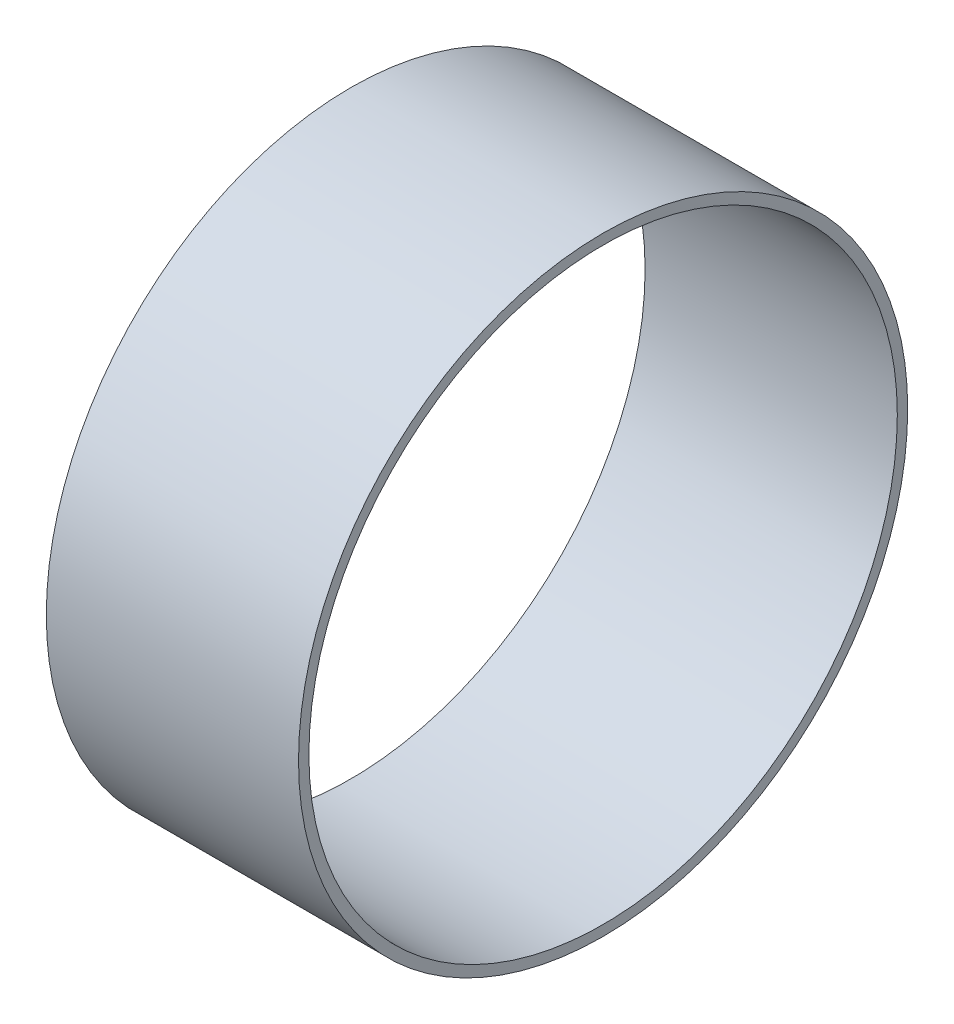
ISO-10303-21;
HEADER;
FILE_DESCRIPTION(('STEP AP214'),'2;1');
FILE_NAME('part.step','',(''),(''),'','','');
FILE_SCHEMA(('AUTOMOTIVE_DESIGN { 1 0 10303 214 1 1 1 1 }'));
ENDSEC;
DATA;
#1=APPLICATION_CONTEXT('core data for automotive mechanical design processes');
#2=APPLICATION_PROTOCOL_DEFINITION('international standard','automotive_design',2000,#1);
#3=PRODUCT_CONTEXT('',#1,'mechanical');
#4=PRODUCT('Part','Part','',(#3));
#5=PRODUCT_RELATED_PRODUCT_CATEGORY('part','',(#4));
#6=PRODUCT_DEFINITION_FORMATION('','',#4);
#7=PRODUCT_DEFINITION_CONTEXT('part definition',#1,'design');
#8=PRODUCT_DEFINITION('design','',#6,#7);
#9=PRODUCT_DEFINITION_SHAPE('','',#8);
#10=(LENGTH_UNIT() NAMED_UNIT(*) SI_UNIT(.MILLI.,.METRE.));
#11=(NAMED_UNIT(*) PLANE_ANGLE_UNIT() SI_UNIT($,.RADIAN.));
#12=(NAMED_UNIT(*) SI_UNIT($,.STERADIAN.) SOLID_ANGLE_UNIT());
#13=UNCERTAINTY_MEASURE_WITH_UNIT(LENGTH_MEASURE(1.E-05),#10,'distance_accuracy_value','');
#14=(GEOMETRIC_REPRESENTATION_CONTEXT(3) GLOBAL_UNCERTAINTY_ASSIGNED_CONTEXT((#13)) GLOBAL_UNIT_ASSIGNED_CONTEXT((#10,
#11,#12)) REPRESENTATION_CONTEXT('',''));
#15=CARTESIAN_POINT('',(0.,0.,0.));
#16=DIRECTION('',(0.,0.,1.));
#17=DIRECTION('',(1.,0.,0.));
#18=AXIS2_PLACEMENT_3D('',#15,#16,#17);
#19=CARTESIAN_POINT('',(-80.61250008,0.,-23.29375));
#20=DIRECTION('',(-1.,0.,0.));
#21=DIRECTION('',(0.,0.,1.));
#22=AXIS2_PLACEMENT_3D('',#19,#20,#21);
#23=PLANE('',#22);
#24=CARTESIAN_POINT('',(-80.61250008,0.,0.));
#25=DIRECTION('',(-1.,0.,0.));
#26=DIRECTION('',(0.,0.,1.));
#27=AXIS2_PLACEMENT_3D('',#24,#25,#26);
#28=CIRCLE('',#27,23.29375);
#29=CARTESIAN_POINT('',(-80.61250008,0.,23.29375));
#30=VERTEX_POINT('',#29);
#31=EDGE_CURVE('E45',#30,#30,#28,.T.);
#32=ORIENTED_EDGE('',*,*,#31,.F.);
#33=EDGE_LOOP('',(#32));
#34=FACE_BOUND('',#33,.T.);
#35=CARTESIAN_POINT('',(-80.61250008,0.,0.));
#36=DIRECTION('',(-1.,0.,0.));
#37=DIRECTION('',(0.,0.,1.));
#38=AXIS2_PLACEMENT_3D('',#35,#36,#37);
#39=CIRCLE('',#38,22.5);
#40=CARTESIAN_POINT('',(-80.61250008,0.,22.5));
#41=VERTEX_POINT('',#40);
#42=EDGE_CURVE('E10',#41,#41,#39,.T.);
#43=ORIENTED_EDGE('',*,*,#42,.T.);
#44=EDGE_LOOP('',(#43));
#45=FACE_BOUND('',#44,.T.);
#46=ADVANCED_FACE('F31',(#34,#45),#23,.F.);
#47=CARTESIAN_POINT('',(-99.900000034,0.,-23.29375));
#48=DIRECTION('',(1.,0.,0.));
#49=DIRECTION('',(0.,0.,-1.));
#50=AXIS2_PLACEMENT_3D('',#47,#48,#49);
#51=PLANE('',#50);
#52=CARTESIAN_POINT('',(-99.900000034,0.,0.));
#53=DIRECTION('',(-1.,0.,0.));
#54=DIRECTION('',(0.,0.,1.));
#55=AXIS2_PLACEMENT_3D('',#52,#53,#54);
#56=CIRCLE('',#55,22.5);
#57=CARTESIAN_POINT('',(-99.900000034,0.,22.5));
#58=VERTEX_POINT('',#57);
#59=EDGE_CURVE('E37',#58,#58,#56,.T.);
#60=ORIENTED_EDGE('',*,*,#59,.F.);
#61=EDGE_LOOP('',(#60));
#62=FACE_BOUND('',#61,.T.);
#63=CARTESIAN_POINT('',(-99.900000034,0.,0.));
#64=DIRECTION('',(-1.,0.,0.));
#65=DIRECTION('',(0.,0.,1.));
#66=AXIS2_PLACEMENT_3D('',#63,#64,#65);
#67=CIRCLE('',#66,23.29375);
#68=CARTESIAN_POINT('',(-99.900000034,0.,23.29375));
#69=VERTEX_POINT('',#68);
#70=EDGE_CURVE('E41',#69,#69,#67,.T.);
#71=ORIENTED_EDGE('',*,*,#70,.T.);
#72=EDGE_LOOP('',(#71));
#73=FACE_BOUND('',#72,.T.);
#74=ADVANCED_FACE('F54',(#62,#73),#51,.F.);
#75=CARTESIAN_POINT('',(-121.0609375317,0.,0.));
#76=DIRECTION('',(-1.,0.,0.));
#77=DIRECTION('',(0.,0.,1.));
#78=AXIS2_PLACEMENT_3D('',#75,#76,#77);
#79=CYLINDRICAL_SURFACE('',#78,23.29375);
#80=ORIENTED_EDGE('',*,*,#70,.F.);
#81=EDGE_LOOP('',(#80));
#82=FACE_BOUND('',#81,.T.);
#83=ORIENTED_EDGE('',*,*,#31,.T.);
#84=EDGE_LOOP('',(#83));
#85=FACE_BOUND('',#84,.T.);
#86=ADVANCED_FACE('F51',(#82,#85),#79,.T.);
#87=CARTESIAN_POINT('',(-121.0609375317,0.,0.));
#88=DIRECTION('',(-1.,0.,0.));
#89=DIRECTION('',(0.,0.,1.));
#90=AXIS2_PLACEMENT_3D('',#87,#88,#89);
#91=CYLINDRICAL_SURFACE('',#90,22.5);
#92=ORIENTED_EDGE('',*,*,#42,.F.);
#93=EDGE_LOOP('',(#92));
#94=FACE_BOUND('',#93,.T.);
#95=ORIENTED_EDGE('',*,*,#59,.T.);
#96=EDGE_LOOP('',(#95));
#97=FACE_BOUND('',#96,.T.);
#98=ADVANCED_FACE('F55',(#94,#97),#91,.F.);
#99=CLOSED_SHELL('',(#46,#74,#86,#98));
#100=MANIFOLD_SOLID_BREP('B2',#99);
#101=ADVANCED_BREP_SHAPE_REPRESENTATION('',(#18,#100),#14);
#102=SHAPE_DEFINITION_REPRESENTATION(#9,#101);
ENDSEC;
END-ISO-10303-21;
